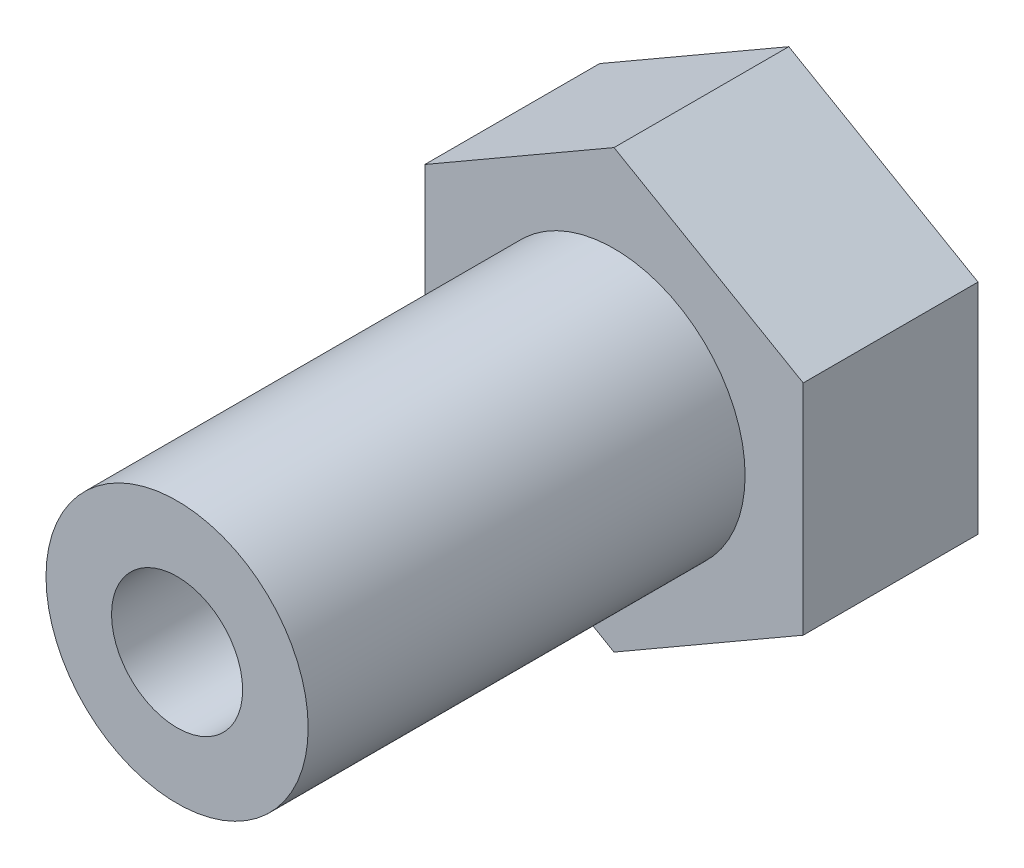
ISO-10303-21;
HEADER;
FILE_DESCRIPTION(('STEP AP214'),'2;1');
FILE_NAME('part.step','',(''),(''),'','','');
FILE_SCHEMA(('AUTOMOTIVE_DESIGN { 1 0 10303 214 1 1 1 1 }'));
ENDSEC;
DATA;
#1=APPLICATION_CONTEXT('core data for automotive mechanical design processes');
#2=APPLICATION_PROTOCOL_DEFINITION('international standard','automotive_design',2000,#1);
#3=PRODUCT_CONTEXT('',#1,'mechanical');
#4=PRODUCT('Part','Part','',(#3));
#5=PRODUCT_RELATED_PRODUCT_CATEGORY('part','',(#4));
#6=PRODUCT_DEFINITION_FORMATION('','',#4);
#7=PRODUCT_DEFINITION_CONTEXT('part definition',#1,'design');
#8=PRODUCT_DEFINITION('design','',#6,#7);
#9=PRODUCT_DEFINITION_SHAPE('','',#8);
#10=(LENGTH_UNIT() NAMED_UNIT(*) SI_UNIT(.MILLI.,.METRE.));
#11=(NAMED_UNIT(*) PLANE_ANGLE_UNIT() SI_UNIT($,.RADIAN.));
#12=(NAMED_UNIT(*) SI_UNIT($,.STERADIAN.) SOLID_ANGLE_UNIT());
#13=UNCERTAINTY_MEASURE_WITH_UNIT(LENGTH_MEASURE(1.E-05),#10,'distance_accuracy_value','');
#14=(GEOMETRIC_REPRESENTATION_CONTEXT(3) GLOBAL_UNCERTAINTY_ASSIGNED_CONTEXT((#13)) GLOBAL_UNIT_ASSIGNED_CONTEXT((#10,
#11,#12)) REPRESENTATION_CONTEXT('',''));
#15=CARTESIAN_POINT('',(0.,0.,0.));
#16=DIRECTION('',(0.,0.,1.));
#17=DIRECTION('',(1.,0.,0.));
#18=AXIS2_PLACEMENT_3D('',#15,#16,#17);
#19=CARTESIAN_POINT('',(0.,0.,8.));
#20=DIRECTION('',(0.,0.,1.));
#21=DIRECTION('',(1.,0.,0.));
#22=AXIS2_PLACEMENT_3D('',#19,#20,#21);
#23=PLANE('',#22);
#24=DIRECTION('',(-0.866025403784439,-0.499999999999999,0.));
#25=VECTOR('',#24,1.);
#26=CARTESIAN_POINT('',(0.,10.,8.));
#27=LINE('',#26,#25);
#28=CARTESIAN_POINT('',(0.,10.,8.));
#29=VERTEX_POINT('',#28);
#30=CARTESIAN_POINT('',(-8.66025403784438,5.00000000000001,8.));
#31=VERTEX_POINT('',#30);
#32=EDGE_CURVE('E134',#29,#31,#27,.T.);
#33=ORIENTED_EDGE('',*,*,#32,.T.);
#34=DIRECTION('',(0.,-1.,0.));
#35=VECTOR('',#34,1.);
#36=CARTESIAN_POINT('',(-8.66025403784438,5.00000000000001,8.));
#37=LINE('',#36,#35);
#38=CARTESIAN_POINT('',(-8.66025403784438,-5.00000000000001,8.));
#39=VERTEX_POINT('',#38);
#40=EDGE_CURVE('E92',#31,#39,#37,.T.);
#41=ORIENTED_EDGE('',*,*,#40,.T.);
#42=DIRECTION('',(0.866025403784439,-0.499999999999999,0.));
#43=VECTOR('',#42,1.);
#44=CARTESIAN_POINT('',(-8.66025403784438,-5.00000000000001,8.));
#45=LINE('',#44,#43);
#46=CARTESIAN_POINT('',(0.,-10.,8.));
#47=VERTEX_POINT('',#46);
#48=EDGE_CURVE('E105',#39,#47,#45,.T.);
#49=ORIENTED_EDGE('',*,*,#48,.T.);
#50=DIRECTION('',(0.866025403784439,0.499999999999999,0.));
#51=VECTOR('',#50,1.);
#52=CARTESIAN_POINT('',(0.,-10.,8.));
#53=LINE('',#52,#51);
#54=CARTESIAN_POINT('',(8.66025403784438,-5.00000000000001,8.));
#55=VERTEX_POINT('',#54);
#56=EDGE_CURVE('E99',#47,#55,#53,.T.);
#57=ORIENTED_EDGE('',*,*,#56,.T.);
#58=DIRECTION('',(0.,1.,0.));
#59=VECTOR('',#58,1.);
#60=CARTESIAN_POINT('',(8.66025403784438,-5.00000000000001,8.));
#61=LINE('',#60,#59);
#62=CARTESIAN_POINT('',(8.66025403784438,5.00000000000001,8.));
#63=VERTEX_POINT('',#62);
#64=EDGE_CURVE('E103',#55,#63,#61,.T.);
#65=ORIENTED_EDGE('',*,*,#64,.T.);
#66=DIRECTION('',(-0.866025403784439,0.499999999999999,0.));
#67=VECTOR('',#66,1.);
#68=CARTESIAN_POINT('',(8.66025403784438,5.00000000000001,8.));
#69=LINE('',#68,#67);
#70=EDGE_CURVE('E54',#63,#29,#69,.T.);
#71=ORIENTED_EDGE('',*,*,#70,.T.);
#72=EDGE_LOOP('',(#33,#41,#49,#57,#65,#71));
#73=FACE_BOUND('',#72,.T.);
#74=CARTESIAN_POINT('',(0.,0.,8.));
#75=DIRECTION('',(0.,0.,1.));
#76=DIRECTION('',(1.,0.,0.));
#77=AXIS2_PLACEMENT_3D('',#74,#75,#76);
#78=CIRCLE('',#77,6.);
#79=CARTESIAN_POINT('',(6.,0.,8.));
#80=VERTEX_POINT('',#79);
#81=EDGE_CURVE('E160',#80,#80,#78,.T.);
#82=ORIENTED_EDGE('',*,*,#81,.F.);
#83=EDGE_LOOP('',(#82));
#84=FACE_BOUND('',#83,.T.);
#85=ADVANCED_FACE('F37',(#73,#84),#23,.T.);
#86=CARTESIAN_POINT('',(0.,0.,0.));
#87=DIRECTION('',(0.,0.,1.));
#88=DIRECTION('',(1.,0.,0.));
#89=AXIS2_PLACEMENT_3D('',#86,#87,#88);
#90=PLANE('',#89);
#91=DIRECTION('',(-0.866025403784439,-0.499999999999999,0.));
#92=VECTOR('',#91,1.);
#93=CARTESIAN_POINT('',(0.,10.,0.));
#94=LINE('',#93,#92);
#95=CARTESIAN_POINT('',(0.,10.,0.));
#96=VERTEX_POINT('',#95);
#97=CARTESIAN_POINT('',(-8.66025403784438,5.00000000000001,0.));
#98=VERTEX_POINT('',#97);
#99=EDGE_CURVE('E123',#96,#98,#94,.T.);
#100=ORIENTED_EDGE('',*,*,#99,.F.);
#101=DIRECTION('',(-0.866025403784439,0.499999999999999,0.));
#102=VECTOR('',#101,1.);
#103=CARTESIAN_POINT('',(8.66025403784438,5.00000000000001,0.));
#104=LINE('',#103,#102);
#105=CARTESIAN_POINT('',(8.66025403784438,5.00000000000001,0.));
#106=VERTEX_POINT('',#105);
#107=EDGE_CURVE('E83',#106,#96,#104,.T.);
#108=ORIENTED_EDGE('',*,*,#107,.F.);
#109=DIRECTION('',(0.,1.,0.));
#110=VECTOR('',#109,1.);
#111=CARTESIAN_POINT('',(8.66025403784438,-5.00000000000001,0.));
#112=LINE('',#111,#110);
#113=CARTESIAN_POINT('',(8.66025403784438,-5.00000000000001,0.));
#114=VERTEX_POINT('',#113);
#115=EDGE_CURVE('E77',#114,#106,#112,.T.);
#116=ORIENTED_EDGE('',*,*,#115,.F.);
#117=DIRECTION('',(0.866025403784439,0.499999999999999,0.));
#118=VECTOR('',#117,1.);
#119=CARTESIAN_POINT('',(0.,-10.,0.));
#120=LINE('',#119,#118);
#121=CARTESIAN_POINT('',(0.,-10.,0.));
#122=VERTEX_POINT('',#121);
#123=EDGE_CURVE('E113',#122,#114,#120,.T.);
#124=ORIENTED_EDGE('',*,*,#123,.F.);
#125=DIRECTION('',(0.866025403784439,-0.499999999999999,0.));
#126=VECTOR('',#125,1.);
#127=CARTESIAN_POINT('',(-8.66025403784438,-5.00000000000001,0.));
#128=LINE('',#127,#126);
#129=CARTESIAN_POINT('',(-8.66025403784438,-5.00000000000001,0.));
#130=VERTEX_POINT('',#129);
#131=EDGE_CURVE('E129',#130,#122,#128,.T.);
#132=ORIENTED_EDGE('',*,*,#131,.F.);
#133=DIRECTION('',(0.,-1.,0.));
#134=VECTOR('',#133,1.);
#135=CARTESIAN_POINT('',(-8.66025403784438,5.00000000000001,0.));
#136=LINE('',#135,#134);
#137=EDGE_CURVE('E126',#98,#130,#136,.T.);
#138=ORIENTED_EDGE('',*,*,#137,.F.);
#139=EDGE_LOOP('',(#100,#108,#116,#124,#132,#138));
#140=FACE_BOUND('',#139,.T.);
#141=CARTESIAN_POINT('',(0.,0.,0.));
#142=DIRECTION('',(0.,0.,1.));
#143=DIRECTION('',(1.,0.,0.));
#144=AXIS2_PLACEMENT_3D('',#141,#142,#143);
#145=CIRCLE('',#144,5.);
#146=CARTESIAN_POINT('',(5.,0.,0.));
#147=VERTEX_POINT('',#146);
#148=EDGE_CURVE('E11',#147,#147,#145,.F.);
#149=ORIENTED_EDGE('',*,*,#148,.F.);
#150=EDGE_LOOP('',(#149));
#151=FACE_BOUND('',#150,.T.);
#152=ADVANCED_FACE('F146',(#140,#151),#90,.F.);
#153=CARTESIAN_POINT('',(0.,10.,8.));
#154=DIRECTION('',(0.499999999999999,-0.866025403784439,0.));
#155=DIRECTION('',(0.866025403784439,0.499999999999999,0.));
#156=AXIS2_PLACEMENT_3D('',#153,#154,#155);
#157=PLANE('',#156);
#158=ORIENTED_EDGE('',*,*,#99,.T.);
#159=DIRECTION('',(0.,0.,-1.));
#160=VECTOR('',#159,1.);
#161=CARTESIAN_POINT('',(-8.66025403784438,5.00000000000001,8.));
#162=LINE('',#161,#160);
#163=EDGE_CURVE('E46',#31,#98,#162,.T.);
#164=ORIENTED_EDGE('',*,*,#163,.F.);
#165=ORIENTED_EDGE('',*,*,#32,.F.);
#166=DIRECTION('',(0.,0.,-1.));
#167=VECTOR('',#166,1.);
#168=CARTESIAN_POINT('',(0.,10.,8.));
#169=LINE('',#168,#167);
#170=EDGE_CURVE('E119',#29,#96,#169,.T.);
#171=ORIENTED_EDGE('',*,*,#170,.T.);
#172=EDGE_LOOP('',(#158,#164,#165,#171));
#173=FACE_BOUND('',#172,.T.);
#174=ADVANCED_FACE('F39',(#173),#157,.F.);
#175=CARTESIAN_POINT('',(-8.66025403784438,5.00000000000001,8.));
#176=DIRECTION('',(1.,0.,0.));
#177=DIRECTION('',(0.,0.,-1.));
#178=AXIS2_PLACEMENT_3D('',#175,#176,#177);
#179=PLANE('',#178);
#180=ORIENTED_EDGE('',*,*,#137,.T.);
#181=DIRECTION('',(0.,0.,-1.));
#182=VECTOR('',#181,1.);
#183=CARTESIAN_POINT('',(-8.66025403784438,-5.00000000000001,8.));
#184=LINE('',#183,#182);
#185=EDGE_CURVE('E138',#39,#130,#184,.T.);
#186=ORIENTED_EDGE('',*,*,#185,.F.);
#187=ORIENTED_EDGE('',*,*,#40,.F.);
#188=ORIENTED_EDGE('',*,*,#163,.T.);
#189=EDGE_LOOP('',(#180,#186,#187,#188));
#190=FACE_BOUND('',#189,.T.);
#191=ADVANCED_FACE('F141',(#190),#179,.F.);
#192=CARTESIAN_POINT('',(-8.66025403784438,-5.00000000000001,8.));
#193=DIRECTION('',(0.499999999999999,0.866025403784439,0.));
#194=DIRECTION('',(-0.866025403784439,0.499999999999999,0.));
#195=AXIS2_PLACEMENT_3D('',#192,#193,#194);
#196=PLANE('',#195);
#197=ORIENTED_EDGE('',*,*,#131,.T.);
#198=DIRECTION('',(0.,0.,-1.));
#199=VECTOR('',#198,1.);
#200=CARTESIAN_POINT('',(0.,-10.,8.));
#201=LINE('',#200,#199);
#202=EDGE_CURVE('E114',#47,#122,#201,.T.);
#203=ORIENTED_EDGE('',*,*,#202,.F.);
#204=ORIENTED_EDGE('',*,*,#48,.F.);
#205=ORIENTED_EDGE('',*,*,#185,.T.);
#206=EDGE_LOOP('',(#197,#203,#204,#205));
#207=FACE_BOUND('',#206,.T.);
#208=ADVANCED_FACE('F150',(#207),#196,.F.);
#209=CARTESIAN_POINT('',(0.,-10.,8.));
#210=DIRECTION('',(-0.499999999999999,0.866025403784439,0.));
#211=DIRECTION('',(-0.866025403784439,-0.499999999999999,0.));
#212=AXIS2_PLACEMENT_3D('',#209,#210,#211);
#213=PLANE('',#212);
#214=ORIENTED_EDGE('',*,*,#123,.T.);
#215=DIRECTION('',(0.,0.,-1.));
#216=VECTOR('',#215,1.);
#217=CARTESIAN_POINT('',(8.66025403784438,-5.00000000000001,8.));
#218=LINE('',#217,#216);
#219=EDGE_CURVE('E110',#55,#114,#218,.T.);
#220=ORIENTED_EDGE('',*,*,#219,.F.);
#221=ORIENTED_EDGE('',*,*,#56,.F.);
#222=ORIENTED_EDGE('',*,*,#202,.T.);
#223=EDGE_LOOP('',(#214,#220,#221,#222));
#224=FACE_BOUND('',#223,.T.);
#225=ADVANCED_FACE('F111',(#224),#213,.F.);
#226=CARTESIAN_POINT('',(8.66025403784438,-5.00000000000001,8.));
#227=DIRECTION('',(-1.,0.,0.));
#228=DIRECTION('',(0.,-1.,0.));
#229=AXIS2_PLACEMENT_3D('',#226,#227,#228);
#230=PLANE('',#229);
#231=ORIENTED_EDGE('',*,*,#115,.T.);
#232=DIRECTION('',(0.,0.,-1.));
#233=VECTOR('',#232,1.);
#234=CARTESIAN_POINT('',(8.66025403784438,5.00000000000001,8.));
#235=LINE('',#234,#233);
#236=EDGE_CURVE('E115',#63,#106,#235,.T.);
#237=ORIENTED_EDGE('',*,*,#236,.F.);
#238=ORIENTED_EDGE('',*,*,#64,.F.);
#239=ORIENTED_EDGE('',*,*,#219,.T.);
#240=EDGE_LOOP('',(#231,#237,#238,#239));
#241=FACE_BOUND('',#240,.T.);
#242=ADVANCED_FACE('F117',(#241),#230,.F.);
#243=CARTESIAN_POINT('',(8.66025403784438,5.00000000000001,8.));
#244=DIRECTION('',(-0.5,-0.866025403784439,0.));
#245=DIRECTION('',(0.866025403784439,-0.499999999999999,0.));
#246=AXIS2_PLACEMENT_3D('',#243,#244,#245);
#247=PLANE('',#246);
#248=ORIENTED_EDGE('',*,*,#107,.T.);
#249=ORIENTED_EDGE('',*,*,#170,.F.);
#250=ORIENTED_EDGE('',*,*,#70,.F.);
#251=ORIENTED_EDGE('',*,*,#236,.T.);
#252=EDGE_LOOP('',(#248,#249,#250,#251));
#253=FACE_BOUND('',#252,.T.);
#254=ADVANCED_FACE('F194',(#253),#247,.F.);
#255=CARTESIAN_POINT('',(0.,0.,8.));
#256=DIRECTION('',(0.,0.,-1.));
#257=DIRECTION('',(-1.,0.,0.));
#258=AXIS2_PLACEMENT_3D('',#255,#256,#257);
#259=CYLINDRICAL_SURFACE('',#258,3.);
#260=CARTESIAN_POINT('',(0.,0.,-1.));
#261=DIRECTION('',(0.,0.,-1.));
#262=DIRECTION('',(-1.,0.,0.));
#263=AXIS2_PLACEMENT_3D('',#260,#261,#262);
#264=CIRCLE('',#263,3.);
#265=CARTESIAN_POINT('',(-3.,0.,-1.));
#266=VERTEX_POINT('',#265);
#267=EDGE_CURVE('E156',#266,#266,#264,.T.);
#268=ORIENTED_EDGE('',*,*,#267,.T.);
#269=EDGE_LOOP('',(#268));
#270=FACE_BOUND('',#269,.T.);
#271=CARTESIAN_POINT('',(0.,0.,28.));
#272=DIRECTION('',(0.,0.,1.));
#273=DIRECTION('',(1.,0.,0.));
#274=AXIS2_PLACEMENT_3D('',#271,#272,#273);
#275=CIRCLE('',#274,3.);
#276=CARTESIAN_POINT('',(3.,0.,28.));
#277=VERTEX_POINT('',#276);
#278=EDGE_CURVE('E163',#277,#277,#275,.T.);
#279=ORIENTED_EDGE('',*,*,#278,.T.);
#280=EDGE_LOOP('',(#279));
#281=FACE_BOUND('',#280,.T.);
#282=ADVANCED_FACE('F169',(#270,#281),#259,.F.);
#283=CARTESIAN_POINT('',(0.,0.,-1.));
#284=DIRECTION('',(0.,0.,-1.));
#285=DIRECTION('',(-1.,0.,0.));
#286=AXIS2_PLACEMENT_3D('',#283,#284,#285);
#287=PLANE('',#286);
#288=CARTESIAN_POINT('',(0.,0.,-1.));
#289=DIRECTION('',(0.,0.,-1.));
#290=DIRECTION('',(-1.,0.,0.));
#291=AXIS2_PLACEMENT_3D('',#288,#289,#290);
#292=CIRCLE('',#291,5.);
#293=CARTESIAN_POINT('',(-5.,0.,-1.));
#294=VERTEX_POINT('',#293);
#295=EDGE_CURVE('E127',#294,#294,#292,.T.);
#296=ORIENTED_EDGE('',*,*,#295,.T.);
#297=EDGE_LOOP('',(#296));
#298=FACE_BOUND('',#297,.T.);
#299=ORIENTED_EDGE('',*,*,#267,.F.);
#300=EDGE_LOOP('',(#299));
#301=FACE_BOUND('',#300,.T.);
#302=ADVANCED_FACE('F183',(#298,#301),#287,.T.);
#303=CARTESIAN_POINT('',(0.,0.,-1.));
#304=DIRECTION('',(0.,0.,1.));
#305=DIRECTION('',(1.,0.,0.));
#306=AXIS2_PLACEMENT_3D('',#303,#304,#305);
#307=CYLINDRICAL_SURFACE('',#306,5.);
#308=ORIENTED_EDGE('',*,*,#295,.F.);
#309=EDGE_LOOP('',(#308));
#310=FACE_BOUND('',#309,.T.);
#311=ORIENTED_EDGE('',*,*,#148,.T.);
#312=EDGE_LOOP('',(#311));
#313=FACE_BOUND('',#312,.T.);
#314=ADVANCED_FACE('F174',(#310,#313),#307,.T.);
#315=CARTESIAN_POINT('',(0.,0.,28.));
#316=DIRECTION('',(0.,0.,1.));
#317=DIRECTION('',(1.,0.,0.));
#318=AXIS2_PLACEMENT_3D('',#315,#316,#317);
#319=PLANE('',#318);
#320=CARTESIAN_POINT('',(0.,0.,28.));
#321=DIRECTION('',(0.,0.,1.));
#322=DIRECTION('',(1.,0.,0.));
#323=AXIS2_PLACEMENT_3D('',#320,#321,#322);
#324=CIRCLE('',#323,6.);
#325=CARTESIAN_POINT('',(6.,0.,28.));
#326=VERTEX_POINT('',#325);
#327=EDGE_CURVE('E159',#326,#326,#324,.T.);
#328=ORIENTED_EDGE('',*,*,#327,.T.);
#329=EDGE_LOOP('',(#328));
#330=FACE_BOUND('',#329,.T.);
#331=ORIENTED_EDGE('',*,*,#278,.F.);
#332=EDGE_LOOP('',(#331));
#333=FACE_BOUND('',#332,.T.);
#334=ADVANCED_FACE('F171',(#330,#333),#319,.T.);
#335=CARTESIAN_POINT('',(0.,0.,28.));
#336=DIRECTION('',(0.,0.,-1.));
#337=DIRECTION('',(-1.,0.,0.));
#338=AXIS2_PLACEMENT_3D('',#335,#336,#337);
#339=CYLINDRICAL_SURFACE('',#338,6.);
#340=ORIENTED_EDGE('',*,*,#327,.F.);
#341=EDGE_LOOP('',(#340));
#342=FACE_BOUND('',#341,.T.);
#343=ORIENTED_EDGE('',*,*,#81,.T.);
#344=EDGE_LOOP('',(#343));
#345=FACE_BOUND('',#344,.T.);
#346=ADVANCED_FACE('F173',(#342,#345),#339,.T.);
#347=CLOSED_SHELL('',(#85,#152,#174,#191,#208,#225,#242,#254,#282,#302,#314,#334,#346));
#348=MANIFOLD_SOLID_BREP('B2',#347);
#349=ADVANCED_BREP_SHAPE_REPRESENTATION('',(#18,#348),#14);
#350=SHAPE_DEFINITION_REPRESENTATION(#9,#349);
ENDSEC;
END-ISO-10303-21;
